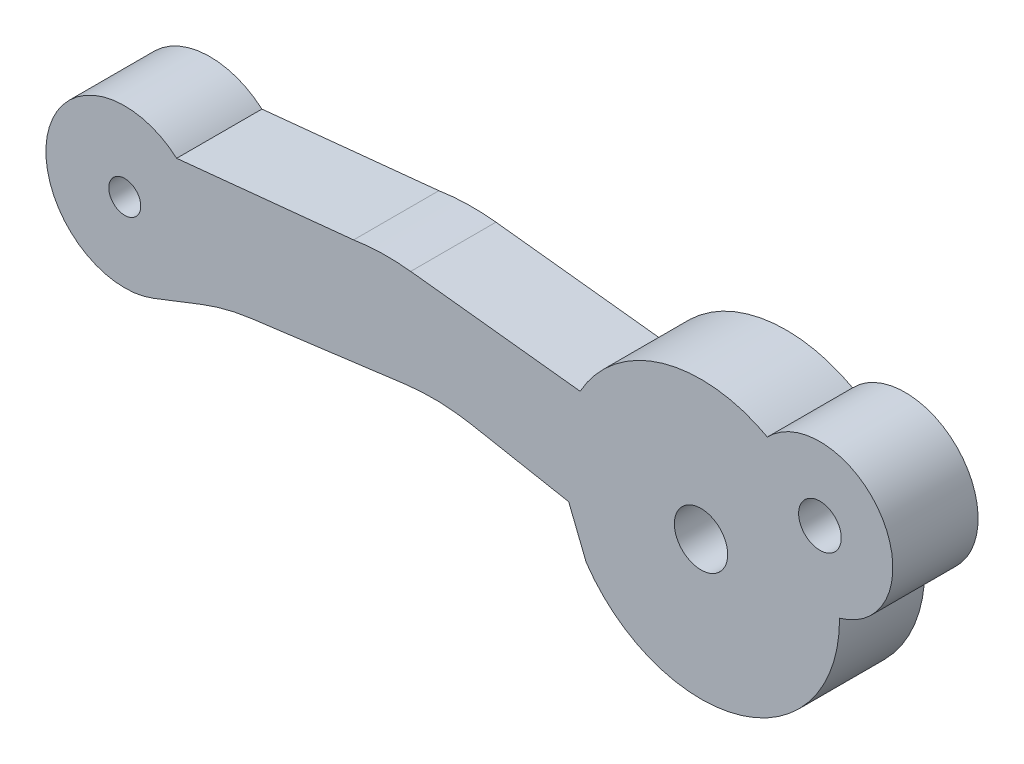
ISO-10303-21;
HEADER;
FILE_DESCRIPTION(('STEP AP214'),'2;1');
FILE_NAME('part.step','',(''),(''),'','','');
FILE_SCHEMA(('AUTOMOTIVE_DESIGN { 1 0 10303 214 1 1 1 1 }'));
ENDSEC;
DATA;
#1=APPLICATION_CONTEXT('core data for automotive mechanical design processes');
#2=APPLICATION_PROTOCOL_DEFINITION('international standard','automotive_design',2000,#1);
#3=PRODUCT_CONTEXT('',#1,'mechanical');
#4=PRODUCT('Part','Part','',(#3));
#5=PRODUCT_RELATED_PRODUCT_CATEGORY('part','',(#4));
#6=PRODUCT_DEFINITION_FORMATION('','',#4);
#7=PRODUCT_DEFINITION_CONTEXT('part definition',#1,'design');
#8=PRODUCT_DEFINITION('design','',#6,#7);
#9=PRODUCT_DEFINITION_SHAPE('','',#8);
#10=(LENGTH_UNIT() NAMED_UNIT(*) SI_UNIT(.MILLI.,.METRE.));
#11=(NAMED_UNIT(*) PLANE_ANGLE_UNIT() SI_UNIT($,.RADIAN.));
#12=(NAMED_UNIT(*) SI_UNIT($,.STERADIAN.) SOLID_ANGLE_UNIT());
#13=UNCERTAINTY_MEASURE_WITH_UNIT(LENGTH_MEASURE(1.E-05),#10,'distance_accuracy_value','');
#14=(GEOMETRIC_REPRESENTATION_CONTEXT(3) GLOBAL_UNCERTAINTY_ASSIGNED_CONTEXT((#13)) GLOBAL_UNIT_ASSIGNED_CONTEXT((#10,
#11,#12)) REPRESENTATION_CONTEXT('',''));
#15=CARTESIAN_POINT('',(0.,0.,0.));
#16=DIRECTION('',(0.,0.,1.));
#17=DIRECTION('',(1.,0.,0.));
#18=AXIS2_PLACEMENT_3D('',#15,#16,#17);
#19=CARTESIAN_POINT('',(39.5075121186215,-7.79263389183328,4.));
#20=DIRECTION('',(0.,0.,1.));
#21=DIRECTION('',(1.,0.,0.));
#22=AXIS2_PLACEMENT_3D('',#19,#20,#21);
#23=PLANE('',#22);
#24=CARTESIAN_POINT('',(39.5075121186215,-7.79263389183328,4.));
#25=DIRECTION('',(0.,0.,1.));
#26=DIRECTION('',(1.,0.,0.));
#27=AXIS2_PLACEMENT_3D('',#24,#25,#26);
#28=CIRCLE('',#27,1.25);
#29=CARTESIAN_POINT('',(40.7575121186214,-7.79263389183328,4.));
#30=VERTEX_POINT('',#29);
#31=EDGE_CURVE('E299',#30,#30,#28,.T.);
#32=ORIENTED_EDGE('',*,*,#31,.F.);
#33=EDGE_LOOP('',(#32));
#34=FACE_BOUND('',#33,.T.);
#35=CARTESIAN_POINT('',(39.5075121186215,-7.79263389183328,4.));
#36=DIRECTION('',(0.,0.,1.));
#37=DIRECTION('',(1.,0.,0.));
#38=AXIS2_PLACEMENT_3D('',#35,#36,#37);
#39=CIRCLE('',#38,6.5);
#40=CARTESIAN_POINT('',(42.6202101554717,-2.08639950027622,4.));
#41=VERTEX_POINT('',#40);
#42=CARTESIAN_POINT('',(33.834920638609,-4.61903878519308,4.));
#43=VERTEX_POINT('',#42);
#44=EDGE_CURVE('E185',#41,#43,#39,.T.);
#45=ORIENTED_EDGE('',*,*,#44,.T.);
#46=DIRECTION('',(-0.993714286527258,0.111946043930204,0.));
#47=VECTOR('',#46,1.);
#48=CARTESIAN_POINT('',(33.834920638609,-4.61903878519308,4.));
#49=LINE('',#48,#47);
#50=CARTESIAN_POINT('',(25.885206346391,-3.72347043375144,4.));
#51=VERTEX_POINT('',#50);
#52=EDGE_CURVE('E108',#43,#51,#49,.T.);
#53=ORIENTED_EDGE('',*,*,#52,.T.);
#54=CARTESIAN_POINT('',(24.7657459070889,-13.660613299024,4.));
#55=DIRECTION('',(0.,0.,1.));
#56=DIRECTION('',(1.,0.,0.));
#57=AXIS2_PLACEMENT_3D('',#54,#55,#56);
#58=CIRCLE('',#57,10.);
#59=CARTESIAN_POINT('',(23.2080292302325,-3.78268240461889,4.));
#60=VERTEX_POINT('',#59);
#61=EDGE_CURVE('E215',#51,#60,#58,.T.);
#62=ORIENTED_EDGE('',*,*,#61,.T.);
#63=DIRECTION('',(-0.994966006421907,-0.100213003471812,0.));
#64=VECTOR('',#63,1.);
#65=CARTESIAN_POINT('',(23.2080292302325,-3.78268240461889,4.));
#66=LINE('',#65,#64);
#67=CARTESIAN_POINT('',(14.904254878639,-4.61903878519308,4.));
#68=VERTEX_POINT('',#67);
#69=EDGE_CURVE('E234',#60,#68,#66,.T.);
#70=ORIENTED_EDGE('',*,*,#69,.T.);
#71=CARTESIAN_POINT('',(12.4697209981751,-7.40526289406754,4.));
#72=DIRECTION('',(0.,0.,1.));
#73=DIRECTION('',(1.,0.,0.));
#74=AXIS2_PLACEMENT_3D('',#71,#72,#73);
#75=CIRCLE('',#74,3.7);
#76=CARTESIAN_POINT('',(13.8130954808045,-10.8527757656056,4.));
#77=VERTEX_POINT('',#76);
#78=EDGE_CURVE('E231',#68,#77,#75,.T.);
#79=ORIENTED_EDGE('',*,*,#78,.T.);
#80=DIRECTION('',(0.931760235550815,0.363074184494424,0.));
#81=VECTOR('',#80,1.);
#82=CARTESIAN_POINT('',(13.8130954808045,-10.8527757656056,4.));
#83=LINE('',#82,#81);
#84=CARTESIAN_POINT('',(16.0664650601085,-9.97471691403126,4.));
#85=VERTEX_POINT('',#84);
#86=EDGE_CURVE('E233',#77,#85,#83,.T.);
#87=ORIENTED_EDGE('',*,*,#86,.T.);
#88=CARTESIAN_POINT('',(19.6972069050527,-19.2923192695394,4.));
#89=DIRECTION('',(0.,0.,-1.));
#90=DIRECTION('',(-1.,0.,0.));
#91=AXIS2_PLACEMENT_3D('',#88,#89,#90);
#92=CIRCLE('',#91,10.);
#93=CARTESIAN_POINT('',(18.4057830892675,-9.37605865739218,4.));
#94=VERTEX_POINT('',#93);
#95=EDGE_CURVE('E236',#85,#94,#92,.T.);
#96=ORIENTED_EDGE('',*,*,#95,.T.);
#97=DIRECTION('',(0.991626061214723,0.129142381578526,0.));
#98=VECTOR('',#97,1.);
#99=CARTESIAN_POINT('',(18.4057830892675,-9.37605865739218,4.));
#100=LINE('',#99,#98);
#101=CARTESIAN_POINT('',(25.6286445263128,-8.43540414630652,4.));
#102=VERTEX_POINT('',#101);
#103=EDGE_CURVE('E242',#94,#102,#100,.T.);
#104=ORIENTED_EDGE('',*,*,#103,.T.);
#105=CARTESIAN_POINT('',(26.9200683420981,-18.3516647584537,4.));
#106=DIRECTION('',(0.,0.,-1.));
#107=DIRECTION('',(-1.,0.,0.));
#108=AXIS2_PLACEMENT_3D('',#105,#106,#107);
#109=CIRCLE('',#108,10.);
#110=CARTESIAN_POINT('',(28.7684044157305,-8.52396646440192,4.));
#111=VERTEX_POINT('',#110);
#112=EDGE_CURVE('E244',#102,#111,#109,.T.);
#113=ORIENTED_EDGE('',*,*,#112,.T.);
#114=DIRECTION('',(0.982769829405183,-0.184833607363237,0.));
#115=VECTOR('',#114,1.);
#116=CARTESIAN_POINT('',(28.7684044157305,-8.52396646440192,4.));
#117=LINE('',#116,#115);
#118=CARTESIAN_POINT('',(33.2990225813806,-9.37605865739218,4.));
#119=VERTEX_POINT('',#118);
#120=EDGE_CURVE('E142',#111,#119,#117,.T.);
#121=ORIENTED_EDGE('',*,*,#120,.T.);
#122=DIRECTION('',(0.371423499389263,-0.928463560998187,0.));
#123=VECTOR('',#122,1.);
#124=CARTESIAN_POINT('',(33.2990225813806,-9.37605865739218,4.));
#125=LINE('',#124,#123);
#126=CARTESIAN_POINT('',(34.1209050671454,-11.4305542418393,4.));
#127=VERTEX_POINT('',#126);
#128=EDGE_CURVE('E136',#119,#127,#125,.T.);
#129=ORIENTED_EDGE('',*,*,#128,.T.);
#130=CARTESIAN_POINT('',(39.5075121186215,-7.79263389183328,4.));
#131=DIRECTION('',(0.,0.,1.));
#132=DIRECTION('',(1.,0.,0.));
#133=AXIS2_PLACEMENT_3D('',#130,#131,#132);
#134=CIRCLE('',#133,6.49999999999999);
#135=CARTESIAN_POINT('',(46.007385342982,-7.75203749740236,4.));
#136=VERTEX_POINT('',#135);
#137=EDGE_CURVE('E140',#127,#136,#134,.T.);
#138=ORIENTED_EDGE('',*,*,#137,.T.);
#139=CARTESIAN_POINT('',(45.0865124808355,-4.45725460929041,4.));
#140=DIRECTION('',(0.,0.,1.));
#141=DIRECTION('',(1.,0.,0.));
#142=AXIS2_PLACEMENT_3D('',#139,#140,#141);
#143=CIRCLE('',#142,3.42105263157895);
#144=EDGE_CURVE('E50',#136,#41,#143,.T.);
#145=ORIENTED_EDGE('',*,*,#144,.T.);
#146=EDGE_LOOP('',(#45,#53,#62,#70,#79,#87,#96,#104,#113,#121,#129,#138,#145));
#147=FACE_BOUND('',#146,.T.);
#148=CARTESIAN_POINT('',(12.4697209981751,-7.40526289406754,4.));
#149=DIRECTION('',(0.,0.,1.));
#150=DIRECTION('',(1.,0.,0.));
#151=AXIS2_PLACEMENT_3D('',#148,#149,#150);
#152=CIRCLE('',#151,0.75);
#153=CARTESIAN_POINT('',(13.2197209981751,-7.40526289406754,4.));
#154=VERTEX_POINT('',#153);
#155=EDGE_CURVE('E164',#154,#154,#152,.T.);
#156=ORIENTED_EDGE('',*,*,#155,.F.);
#157=EDGE_LOOP('',(#156));
#158=FACE_BOUND('',#157,.T.);
#159=CARTESIAN_POINT('',(45.0865124808355,-4.45725460929041,4.));
#160=DIRECTION('',(0.,0.,1.));
#161=DIRECTION('',(1.,0.,0.));
#162=AXIS2_PLACEMENT_3D('',#159,#160,#161);
#163=CIRCLE('',#162,0.999999999999998);
#164=CARTESIAN_POINT('',(46.0865124808355,-4.45725460929041,4.));
#165=VERTEX_POINT('',#164);
#166=EDGE_CURVE('E290',#165,#165,#163,.T.);
#167=ORIENTED_EDGE('',*,*,#166,.F.);
#168=EDGE_LOOP('',(#167));
#169=FACE_BOUND('',#168,.T.);
#170=ADVANCED_FACE('F33',(#34,#147,#158,#169),#23,.T.);
#171=CARTESIAN_POINT('',(39.5075121186215,-7.79263389183328,0.));
#172=DIRECTION('',(0.,0.,1.));
#173=DIRECTION('',(1.,0.,0.));
#174=AXIS2_PLACEMENT_3D('',#171,#172,#173);
#175=PLANE('',#174);
#176=CARTESIAN_POINT('',(39.5075121186215,-7.79263389183328,0.));
#177=DIRECTION('',(0.,0.,1.));
#178=DIRECTION('',(1.,0.,0.));
#179=AXIS2_PLACEMENT_3D('',#176,#177,#178);
#180=CIRCLE('',#179,6.5);
#181=CARTESIAN_POINT('',(42.6202101554717,-2.08639950027622,0.));
#182=VERTEX_POINT('',#181);
#183=CARTESIAN_POINT('',(33.834920638609,-4.61903878519308,0.));
#184=VERTEX_POINT('',#183);
#185=EDGE_CURVE('E160',#182,#184,#180,.T.);
#186=ORIENTED_EDGE('',*,*,#185,.F.);
#187=CARTESIAN_POINT('',(45.0865124808355,-4.45725460929041,0.));
#188=DIRECTION('',(0.,0.,1.));
#189=DIRECTION('',(1.,0.,0.));
#190=AXIS2_PLACEMENT_3D('',#187,#188,#189);
#191=CIRCLE('',#190,3.42105263157895);
#192=CARTESIAN_POINT('',(46.007385342982,-7.75203749740236,0.));
#193=VERTEX_POINT('',#192);
#194=EDGE_CURVE('E100',#193,#182,#191,.T.);
#195=ORIENTED_EDGE('',*,*,#194,.F.);
#196=CARTESIAN_POINT('',(39.5075121186215,-7.79263389183328,0.));
#197=DIRECTION('',(0.,0.,1.));
#198=DIRECTION('',(1.,0.,0.));
#199=AXIS2_PLACEMENT_3D('',#196,#197,#198);
#200=CIRCLE('',#199,6.49999999999999);
#201=CARTESIAN_POINT('',(34.1209050671454,-11.4305542418393,0.));
#202=VERTEX_POINT('',#201);
#203=EDGE_CURVE('E94',#202,#193,#200,.T.);
#204=ORIENTED_EDGE('',*,*,#203,.F.);
#205=DIRECTION('',(0.371423499389263,-0.928463560998187,0.));
#206=VECTOR('',#205,1.);
#207=CARTESIAN_POINT('',(33.2990225813806,-9.37605865739218,0.));
#208=LINE('',#207,#206);
#209=CARTESIAN_POINT('',(33.2990225813806,-9.37605865739218,0.));
#210=VERTEX_POINT('',#209);
#211=EDGE_CURVE('E150',#210,#202,#208,.T.);
#212=ORIENTED_EDGE('',*,*,#211,.F.);
#213=DIRECTION('',(0.982769829405183,-0.184833607363237,0.));
#214=VECTOR('',#213,1.);
#215=CARTESIAN_POINT('',(28.7684044157305,-8.52396646440192,0.));
#216=LINE('',#215,#214);
#217=CARTESIAN_POINT('',(28.7684044157305,-8.52396646440192,0.));
#218=VERTEX_POINT('',#217);
#219=EDGE_CURVE('E180',#218,#210,#216,.T.);
#220=ORIENTED_EDGE('',*,*,#219,.F.);
#221=CARTESIAN_POINT('',(26.9200683420981,-18.3516647584537,0.));
#222=DIRECTION('',(0.,0.,-1.));
#223=DIRECTION('',(-1.,0.,0.));
#224=AXIS2_PLACEMENT_3D('',#221,#222,#223);
#225=CIRCLE('',#224,10.);
#226=CARTESIAN_POINT('',(25.6286445263128,-8.43540414630652,0.));
#227=VERTEX_POINT('',#226);
#228=EDGE_CURVE('E178',#227,#218,#225,.T.);
#229=ORIENTED_EDGE('',*,*,#228,.F.);
#230=DIRECTION('',(0.991626061214723,0.129142381578526,0.));
#231=VECTOR('',#230,1.);
#232=CARTESIAN_POINT('',(18.4057830892675,-9.37605865739218,0.));
#233=LINE('',#232,#231);
#234=CARTESIAN_POINT('',(18.4057830892675,-9.37605865739218,0.));
#235=VERTEX_POINT('',#234);
#236=EDGE_CURVE('E176',#235,#227,#233,.T.);
#237=ORIENTED_EDGE('',*,*,#236,.F.);
#238=CARTESIAN_POINT('',(19.6972069050527,-19.2923192695394,0.));
#239=DIRECTION('',(0.,0.,-1.));
#240=DIRECTION('',(-1.,0.,0.));
#241=AXIS2_PLACEMENT_3D('',#238,#239,#240);
#242=CIRCLE('',#241,10.);
#243=CARTESIAN_POINT('',(16.0664650601085,-9.97471691403126,0.));
#244=VERTEX_POINT('',#243);
#245=EDGE_CURVE('E174',#244,#235,#242,.T.);
#246=ORIENTED_EDGE('',*,*,#245,.F.);
#247=DIRECTION('',(0.931760235550815,0.363074184494424,0.));
#248=VECTOR('',#247,1.);
#249=CARTESIAN_POINT('',(13.8130954808045,-10.8527757656056,0.));
#250=LINE('',#249,#248);
#251=CARTESIAN_POINT('',(13.8130954808045,-10.8527757656056,0.));
#252=VERTEX_POINT('',#251);
#253=EDGE_CURVE('E172',#252,#244,#250,.T.);
#254=ORIENTED_EDGE('',*,*,#253,.F.);
#255=CARTESIAN_POINT('',(12.4697209981751,-7.40526289406754,0.));
#256=DIRECTION('',(0.,0.,1.));
#257=DIRECTION('',(1.,0.,0.));
#258=AXIS2_PLACEMENT_3D('',#255,#256,#257);
#259=CIRCLE('',#258,3.7);
#260=CARTESIAN_POINT('',(14.904254878639,-4.61903878519308,0.));
#261=VERTEX_POINT('',#260);
#262=EDGE_CURVE('E170',#261,#252,#259,.T.);
#263=ORIENTED_EDGE('',*,*,#262,.F.);
#264=DIRECTION('',(-0.994966006421907,-0.100213003471812,0.));
#265=VECTOR('',#264,1.);
#266=CARTESIAN_POINT('',(23.2080292302325,-3.78268240461889,0.));
#267=LINE('',#266,#265);
#268=CARTESIAN_POINT('',(23.2080292302325,-3.78268240461889,0.));
#269=VERTEX_POINT('',#268);
#270=EDGE_CURVE('E168',#269,#261,#267,.T.);
#271=ORIENTED_EDGE('',*,*,#270,.F.);
#272=CARTESIAN_POINT('',(24.7657459070889,-13.660613299024,0.));
#273=DIRECTION('',(0.,0.,1.));
#274=DIRECTION('',(1.,0.,0.));
#275=AXIS2_PLACEMENT_3D('',#272,#273,#274);
#276=CIRCLE('',#275,10.);
#277=CARTESIAN_POINT('',(25.885206346391,-3.72347043375144,0.));
#278=VERTEX_POINT('',#277);
#279=EDGE_CURVE('E166',#278,#269,#276,.T.);
#280=ORIENTED_EDGE('',*,*,#279,.F.);
#281=DIRECTION('',(-0.993714286527258,0.111946043930204,0.));
#282=VECTOR('',#281,1.);
#283=CARTESIAN_POINT('',(33.834920638609,-4.61903878519308,0.));
#284=LINE('',#283,#282);
#285=EDGE_CURVE('E163',#184,#278,#284,.T.);
#286=ORIENTED_EDGE('',*,*,#285,.F.);
#287=EDGE_LOOP('',(#186,#195,#204,#212,#220,#229,#237,#246,#254,#263,#271,#280,#286));
#288=FACE_BOUND('',#287,.T.);
#289=CARTESIAN_POINT('',(12.4697209981751,-7.40526289406754,0.));
#290=DIRECTION('',(0.,0.,1.));
#291=DIRECTION('',(1.,0.,0.));
#292=AXIS2_PLACEMENT_3D('',#289,#290,#291);
#293=CIRCLE('',#292,0.75);
#294=CARTESIAN_POINT('',(13.2197209981751,-7.40526289406754,0.));
#295=VERTEX_POINT('',#294);
#296=EDGE_CURVE('E302',#295,#295,#293,.T.);
#297=ORIENTED_EDGE('',*,*,#296,.T.);
#298=EDGE_LOOP('',(#297));
#299=FACE_BOUND('',#298,.T.);
#300=CARTESIAN_POINT('',(39.5075121186215,-7.79263389183328,0.));
#301=DIRECTION('',(0.,0.,1.));
#302=DIRECTION('',(1.,0.,0.));
#303=AXIS2_PLACEMENT_3D('',#300,#301,#302);
#304=CIRCLE('',#303,1.25);
#305=CARTESIAN_POINT('',(40.7575121186214,-7.79263389183328,0.));
#306=VERTEX_POINT('',#305);
#307=EDGE_CURVE('E296',#306,#306,#304,.T.);
#308=ORIENTED_EDGE('',*,*,#307,.T.);
#309=EDGE_LOOP('',(#308));
#310=FACE_BOUND('',#309,.T.);
#311=CARTESIAN_POINT('',(45.0865124808355,-4.45725460929041,0.));
#312=DIRECTION('',(0.,0.,1.));
#313=DIRECTION('',(1.,0.,0.));
#314=AXIS2_PLACEMENT_3D('',#311,#312,#313);
#315=CIRCLE('',#314,0.999999999999998);
#316=CARTESIAN_POINT('',(46.0865124808355,-4.45725460929041,0.));
#317=VERTEX_POINT('',#316);
#318=EDGE_CURVE('E293',#317,#317,#315,.T.);
#319=ORIENTED_EDGE('',*,*,#318,.T.);
#320=EDGE_LOOP('',(#319));
#321=FACE_BOUND('',#320,.T.);
#322=ADVANCED_FACE('F219',(#288,#299,#310,#321),#175,.F.);
#323=CARTESIAN_POINT('',(39.5075121186215,-7.79263389183328,4.));
#324=DIRECTION('',(0.,0.,-1.));
#325=DIRECTION('',(-1.,0.,0.));
#326=AXIS2_PLACEMENT_3D('',#323,#324,#325);
#327=CYLINDRICAL_SURFACE('',#326,6.5);
#328=ORIENTED_EDGE('',*,*,#185,.T.);
#329=DIRECTION('',(0.,0.,-1.));
#330=VECTOR('',#329,1.);
#331=CARTESIAN_POINT('',(33.834920638609,-4.61903878519308,4.));
#332=LINE('',#331,#330);
#333=EDGE_CURVE('E11',#43,#184,#332,.T.);
#334=ORIENTED_EDGE('',*,*,#333,.F.);
#335=ORIENTED_EDGE('',*,*,#44,.F.);
#336=DIRECTION('',(0.,0.,-1.));
#337=VECTOR('',#336,1.);
#338=CARTESIAN_POINT('',(42.6202101554717,-2.08639950027622,4.));
#339=LINE('',#338,#337);
#340=EDGE_CURVE('E156',#41,#182,#339,.T.);
#341=ORIENTED_EDGE('',*,*,#340,.T.);
#342=EDGE_LOOP('',(#328,#334,#335,#341));
#343=FACE_BOUND('',#342,.T.);
#344=ADVANCED_FACE('F35',(#343),#327,.T.);
#345=CARTESIAN_POINT('',(33.834920638609,-4.61903878519308,4.));
#346=DIRECTION('',(-0.111946043930204,-0.993714286527258,0.));
#347=DIRECTION('',(0.993714286527258,-0.111946043930204,0.));
#348=AXIS2_PLACEMENT_3D('',#345,#346,#347);
#349=PLANE('',#348);
#350=ORIENTED_EDGE('',*,*,#285,.T.);
#351=DIRECTION('',(0.,0.,-1.));
#352=VECTOR('',#351,1.);
#353=CARTESIAN_POINT('',(25.885206346391,-3.72347043375144,4.));
#354=LINE('',#353,#352);
#355=EDGE_CURVE('E42',#51,#278,#354,.T.);
#356=ORIENTED_EDGE('',*,*,#355,.F.);
#357=ORIENTED_EDGE('',*,*,#52,.F.);
#358=ORIENTED_EDGE('',*,*,#333,.T.);
#359=EDGE_LOOP('',(#350,#356,#357,#358));
#360=FACE_BOUND('',#359,.T.);
#361=ADVANCED_FACE('F414',(#360),#349,.F.);
#362=CARTESIAN_POINT('',(24.7657459070889,-13.660613299024,4.));
#363=DIRECTION('',(0.,0.,-1.));
#364=DIRECTION('',(-1.,0.,0.));
#365=AXIS2_PLACEMENT_3D('',#362,#363,#364);
#366=CYLINDRICAL_SURFACE('',#365,10.);
#367=ORIENTED_EDGE('',*,*,#279,.T.);
#368=DIRECTION('',(0.,0.,-1.));
#369=VECTOR('',#368,1.);
#370=CARTESIAN_POINT('',(23.2080292302325,-3.78268240461889,4.));
#371=LINE('',#370,#369);
#372=EDGE_CURVE('E207',#60,#269,#371,.T.);
#373=ORIENTED_EDGE('',*,*,#372,.F.);
#374=ORIENTED_EDGE('',*,*,#61,.F.);
#375=ORIENTED_EDGE('',*,*,#355,.T.);
#376=EDGE_LOOP('',(#367,#373,#374,#375));
#377=FACE_BOUND('',#376,.T.);
#378=ADVANCED_FACE('F213',(#377),#366,.T.);
#379=CARTESIAN_POINT('',(23.2080292302325,-3.78268240461889,4.));
#380=DIRECTION('',(0.100213003471812,-0.994966006421907,0.));
#381=DIRECTION('',(0.994966006421907,0.100213003471812,0.));
#382=AXIS2_PLACEMENT_3D('',#379,#380,#381);
#383=PLANE('',#382);
#384=ORIENTED_EDGE('',*,*,#270,.T.);
#385=DIRECTION('',(0.,0.,-1.));
#386=VECTOR('',#385,1.);
#387=CARTESIAN_POINT('',(14.904254878639,-4.61903878519308,4.));
#388=LINE('',#387,#386);
#389=EDGE_CURVE('E204',#68,#261,#388,.T.);
#390=ORIENTED_EDGE('',*,*,#389,.F.);
#391=ORIENTED_EDGE('',*,*,#69,.F.);
#392=ORIENTED_EDGE('',*,*,#372,.T.);
#393=EDGE_LOOP('',(#384,#390,#391,#392));
#394=FACE_BOUND('',#393,.T.);
#395=ADVANCED_FACE('F225',(#394),#383,.F.);
#396=CARTESIAN_POINT('',(12.4697209981751,-7.40526289406754,4.));
#397=DIRECTION('',(0.,0.,-1.));
#398=DIRECTION('',(-1.,0.,0.));
#399=AXIS2_PLACEMENT_3D('',#396,#397,#398);
#400=CYLINDRICAL_SURFACE('',#399,3.7);
#401=ORIENTED_EDGE('',*,*,#262,.T.);
#402=DIRECTION('',(0.,0.,-1.));
#403=VECTOR('',#402,1.);
#404=CARTESIAN_POINT('',(13.8130954808045,-10.8527757656056,4.));
#405=LINE('',#404,#403);
#406=EDGE_CURVE('E201',#77,#252,#405,.T.);
#407=ORIENTED_EDGE('',*,*,#406,.F.);
#408=ORIENTED_EDGE('',*,*,#78,.F.);
#409=ORIENTED_EDGE('',*,*,#389,.T.);
#410=EDGE_LOOP('',(#401,#407,#408,#409));
#411=FACE_BOUND('',#410,.T.);
#412=ADVANCED_FACE('F229',(#411),#400,.T.);
#413=CARTESIAN_POINT('',(13.8130954808045,-10.8527757656056,4.));
#414=DIRECTION('',(-0.363074184494424,0.931760235550815,0.));
#415=DIRECTION('',(-0.931760235550815,-0.363074184494424,0.));
#416=AXIS2_PLACEMENT_3D('',#413,#414,#415);
#417=PLANE('',#416);
#418=ORIENTED_EDGE('',*,*,#253,.T.);
#419=DIRECTION('',(0.,0.,-1.));
#420=VECTOR('',#419,1.);
#421=CARTESIAN_POINT('',(16.0664650601085,-9.97471691403126,4.));
#422=LINE('',#421,#420);
#423=EDGE_CURVE('E198',#85,#244,#422,.T.);
#424=ORIENTED_EDGE('',*,*,#423,.F.);
#425=ORIENTED_EDGE('',*,*,#86,.F.);
#426=ORIENTED_EDGE('',*,*,#406,.T.);
#427=EDGE_LOOP('',(#418,#424,#425,#426));
#428=FACE_BOUND('',#427,.T.);
#429=ADVANCED_FACE('F379',(#428),#417,.F.);
#430=CARTESIAN_POINT('',(19.6972069050527,-19.2923192695394,4.));
#431=DIRECTION('',(0.,0.,-1.));
#432=DIRECTION('',(-1.,0.,0.));
#433=AXIS2_PLACEMENT_3D('',#430,#431,#432);
#434=CYLINDRICAL_SURFACE('',#433,10.);
#435=ORIENTED_EDGE('',*,*,#245,.T.);
#436=DIRECTION('',(0.,0.,-1.));
#437=VECTOR('',#436,1.);
#438=CARTESIAN_POINT('',(18.4057830892675,-9.37605865739218,4.));
#439=LINE('',#438,#437);
#440=EDGE_CURVE('E195',#94,#235,#439,.T.);
#441=ORIENTED_EDGE('',*,*,#440,.F.);
#442=ORIENTED_EDGE('',*,*,#95,.F.);
#443=ORIENTED_EDGE('',*,*,#423,.T.);
#444=EDGE_LOOP('',(#435,#441,#442,#443));
#445=FACE_BOUND('',#444,.T.);
#446=ADVANCED_FACE('F369',(#445),#434,.F.);
#447=CARTESIAN_POINT('',(18.4057830892675,-9.37605865739218,4.));
#448=DIRECTION('',(-0.129142381578526,0.991626061214723,0.));
#449=DIRECTION('',(-0.991626061214723,-0.129142381578526,0.));
#450=AXIS2_PLACEMENT_3D('',#447,#448,#449);
#451=PLANE('',#450);
#452=ORIENTED_EDGE('',*,*,#236,.T.);
#453=DIRECTION('',(0.,0.,-1.));
#454=VECTOR('',#453,1.);
#455=CARTESIAN_POINT('',(25.6286445263128,-8.43540414630652,4.));
#456=LINE('',#455,#454);
#457=EDGE_CURVE('E192',#102,#227,#456,.T.);
#458=ORIENTED_EDGE('',*,*,#457,.F.);
#459=ORIENTED_EDGE('',*,*,#103,.F.);
#460=ORIENTED_EDGE('',*,*,#440,.T.);
#461=EDGE_LOOP('',(#452,#458,#459,#460));
#462=FACE_BOUND('',#461,.T.);
#463=ADVANCED_FACE('F360',(#462),#451,.F.);
#464=CARTESIAN_POINT('',(26.9200683420981,-18.3516647584537,4.));
#465=DIRECTION('',(0.,0.,-1.));
#466=DIRECTION('',(-1.,0.,0.));
#467=AXIS2_PLACEMENT_3D('',#464,#465,#466);
#468=CYLINDRICAL_SURFACE('',#467,10.);
#469=ORIENTED_EDGE('',*,*,#228,.T.);
#470=DIRECTION('',(0.,0.,-1.));
#471=VECTOR('',#470,1.);
#472=CARTESIAN_POINT('',(28.7684044157305,-8.52396646440192,4.));
#473=LINE('',#472,#471);
#474=EDGE_CURVE('E189',#111,#218,#473,.T.);
#475=ORIENTED_EDGE('',*,*,#474,.F.);
#476=ORIENTED_EDGE('',*,*,#112,.F.);
#477=ORIENTED_EDGE('',*,*,#457,.T.);
#478=EDGE_LOOP('',(#469,#475,#476,#477));
#479=FACE_BOUND('',#478,.T.);
#480=ADVANCED_FACE('F250',(#479),#468,.F.);
#481=CARTESIAN_POINT('',(28.7684044157305,-8.52396646440192,4.));
#482=DIRECTION('',(0.184833607363237,0.982769829405183,0.));
#483=DIRECTION('',(-0.982769829405183,0.184833607363237,0.));
#484=AXIS2_PLACEMENT_3D('',#481,#482,#483);
#485=PLANE('',#484);
#486=ORIENTED_EDGE('',*,*,#219,.T.);
#487=DIRECTION('',(0.,0.,-1.));
#488=VECTOR('',#487,1.);
#489=CARTESIAN_POINT('',(33.2990225813806,-9.37605865739218,4.));
#490=LINE('',#489,#488);
#491=EDGE_CURVE('E151',#119,#210,#490,.T.);
#492=ORIENTED_EDGE('',*,*,#491,.F.);
#493=ORIENTED_EDGE('',*,*,#120,.F.);
#494=ORIENTED_EDGE('',*,*,#474,.T.);
#495=EDGE_LOOP('',(#486,#492,#493,#494));
#496=FACE_BOUND('',#495,.T.);
#497=ADVANCED_FACE('F254',(#496),#485,.F.);
#498=CARTESIAN_POINT('',(33.2990225813806,-9.37605865739218,4.));
#499=DIRECTION('',(0.928463560998187,0.371423499389263,0.));
#500=DIRECTION('',(-0.371423499389263,0.928463560998187,0.));
#501=AXIS2_PLACEMENT_3D('',#498,#499,#500);
#502=PLANE('',#501);
#503=ORIENTED_EDGE('',*,*,#211,.T.);
#504=DIRECTION('',(0.,0.,-1.));
#505=VECTOR('',#504,1.);
#506=CARTESIAN_POINT('',(34.1209050671454,-11.4305542418393,4.));
#507=LINE('',#506,#505);
#508=EDGE_CURVE('E147',#127,#202,#507,.T.);
#509=ORIENTED_EDGE('',*,*,#508,.F.);
#510=ORIENTED_EDGE('',*,*,#128,.F.);
#511=ORIENTED_EDGE('',*,*,#491,.T.);
#512=EDGE_LOOP('',(#503,#509,#510,#511));
#513=FACE_BOUND('',#512,.T.);
#514=ADVANCED_FACE('F148',(#513),#502,.F.);
#515=CARTESIAN_POINT('',(39.5075121186215,-7.79263389183328,4.));
#516=DIRECTION('',(0.,0.,-1.));
#517=DIRECTION('',(-1.,0.,0.));
#518=AXIS2_PLACEMENT_3D('',#515,#516,#517);
#519=CYLINDRICAL_SURFACE('',#518,6.49999999999999);
#520=ORIENTED_EDGE('',*,*,#203,.T.);
#521=DIRECTION('',(0.,0.,-1.));
#522=VECTOR('',#521,1.);
#523=CARTESIAN_POINT('',(46.007385342982,-7.75203749740236,4.));
#524=LINE('',#523,#522);
#525=EDGE_CURVE('E152',#136,#193,#524,.T.);
#526=ORIENTED_EDGE('',*,*,#525,.F.);
#527=ORIENTED_EDGE('',*,*,#137,.F.);
#528=ORIENTED_EDGE('',*,*,#508,.T.);
#529=EDGE_LOOP('',(#520,#526,#527,#528));
#530=FACE_BOUND('',#529,.T.);
#531=ADVANCED_FACE('F154',(#530),#519,.T.);
#532=CARTESIAN_POINT('',(45.0865124808355,-4.45725460929041,4.));
#533=DIRECTION('',(0.,0.,-1.));
#534=DIRECTION('',(-1.,0.,0.));
#535=AXIS2_PLACEMENT_3D('',#532,#533,#534);
#536=CYLINDRICAL_SURFACE('',#535,3.42105263157895);
#537=ORIENTED_EDGE('',*,*,#194,.T.);
#538=ORIENTED_EDGE('',*,*,#340,.F.);
#539=ORIENTED_EDGE('',*,*,#144,.F.);
#540=ORIENTED_EDGE('',*,*,#525,.T.);
#541=EDGE_LOOP('',(#537,#538,#539,#540));
#542=FACE_BOUND('',#541,.T.);
#543=ADVANCED_FACE('F258',(#542),#536,.T.);
#544=CARTESIAN_POINT('',(12.4697209981751,-7.40526289406754,4.));
#545=DIRECTION('',(0.,0.,-1.));
#546=DIRECTION('',(-1.,0.,0.));
#547=AXIS2_PLACEMENT_3D('',#544,#545,#546);
#548=CYLINDRICAL_SURFACE('',#547,0.75);
#549=ORIENTED_EDGE('',*,*,#155,.T.);
#550=EDGE_LOOP('',(#549));
#551=FACE_BOUND('',#550,.T.);
#552=ORIENTED_EDGE('',*,*,#296,.F.);
#553=EDGE_LOOP('',(#552));
#554=FACE_BOUND('',#553,.T.);
#555=ADVANCED_FACE('F260',(#551,#554),#548,.F.);
#556=CARTESIAN_POINT('',(39.5075121186215,-7.79263389183328,4.));
#557=DIRECTION('',(0.,0.,-1.));
#558=DIRECTION('',(-1.,0.,0.));
#559=AXIS2_PLACEMENT_3D('',#556,#557,#558);
#560=CYLINDRICAL_SURFACE('',#559,1.25);
#561=ORIENTED_EDGE('',*,*,#31,.T.);
#562=EDGE_LOOP('',(#561));
#563=FACE_BOUND('',#562,.T.);
#564=ORIENTED_EDGE('',*,*,#307,.F.);
#565=EDGE_LOOP('',(#564));
#566=FACE_BOUND('',#565,.T.);
#567=ADVANCED_FACE('F266',(#563,#566),#560,.F.);
#568=CARTESIAN_POINT('',(45.0865124808355,-4.45725460929041,4.));
#569=DIRECTION('',(0.,0.,-1.));
#570=DIRECTION('',(-1.,0.,0.));
#571=AXIS2_PLACEMENT_3D('',#568,#569,#570);
#572=CYLINDRICAL_SURFACE('',#571,0.999999999999998);
#573=ORIENTED_EDGE('',*,*,#166,.T.);
#574=EDGE_LOOP('',(#573));
#575=FACE_BOUND('',#574,.T.);
#576=ORIENTED_EDGE('',*,*,#318,.F.);
#577=EDGE_LOOP('',(#576));
#578=FACE_BOUND('',#577,.T.);
#579=ADVANCED_FACE('F281',(#575,#578),#572,.F.);
#580=CLOSED_SHELL('',(#170,#322,#344,#361,#378,#395,#412,#429,#446,#463,#480,#497,#514,#531,
#543,#555,#567,#579));
#581=MANIFOLD_SOLID_BREP('B2',#580);
#582=ADVANCED_BREP_SHAPE_REPRESENTATION('',(#18,#581),#14);
#583=SHAPE_DEFINITION_REPRESENTATION(#9,#582);
ENDSEC;
END-ISO-10303-21;
